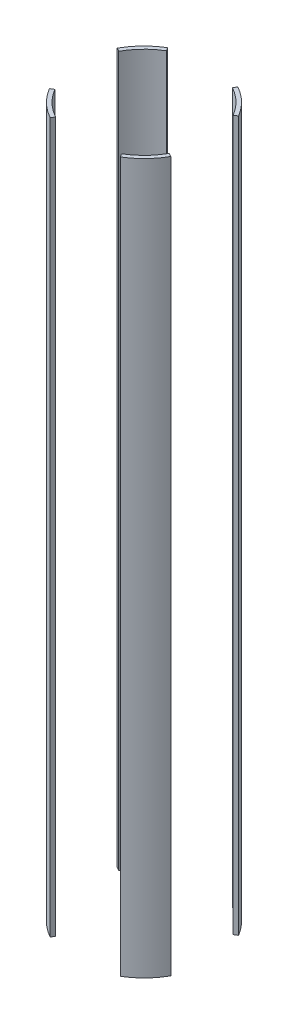
ISO-10303-21;
HEADER;
FILE_DESCRIPTION(('STEP AP214'),'2;1');
FILE_NAME('part.step','',(''),(''),'','','');
FILE_SCHEMA(('AUTOMOTIVE_DESIGN { 1 0 10303 214 1 1 1 1 }'));
ENDSEC;
DATA;
#1=APPLICATION_CONTEXT('core data for automotive mechanical design processes');
#2=APPLICATION_PROTOCOL_DEFINITION('international standard','automotive_design',2000,#1);
#3=PRODUCT_CONTEXT('',#1,'mechanical');
#4=PRODUCT('Part','Part','',(#3));
#5=PRODUCT_RELATED_PRODUCT_CATEGORY('part','',(#4));
#6=PRODUCT_DEFINITION_FORMATION('','',#4);
#7=PRODUCT_DEFINITION_CONTEXT('part definition',#1,'design');
#8=PRODUCT_DEFINITION('design','',#6,#7);
#9=PRODUCT_DEFINITION_SHAPE('','',#8);
#10=(LENGTH_UNIT() NAMED_UNIT(*) SI_UNIT(.MILLI.,.METRE.));
#11=(NAMED_UNIT(*) PLANE_ANGLE_UNIT() SI_UNIT($,.RADIAN.));
#12=(NAMED_UNIT(*) SI_UNIT($,.STERADIAN.) SOLID_ANGLE_UNIT());
#13=UNCERTAINTY_MEASURE_WITH_UNIT(LENGTH_MEASURE(1.E-05),#10,'distance_accuracy_value','');
#14=(GEOMETRIC_REPRESENTATION_CONTEXT(3) GLOBAL_UNCERTAINTY_ASSIGNED_CONTEXT((#13)) GLOBAL_UNIT_ASSIGNED_CONTEXT((#10,
#11,#12)) REPRESENTATION_CONTEXT('',''));
#15=CARTESIAN_POINT('',(0.,0.,0.));
#16=DIRECTION('',(0.,0.,1.));
#17=DIRECTION('',(1.,0.,0.));
#18=AXIS2_PLACEMENT_3D('',#15,#16,#17);
#19=CARTESIAN_POINT('',(0.,-457.2,0.));
#20=DIRECTION('',(0.,1.,0.));
#21=DIRECTION('',(0.,0.,1.));
#22=AXIS2_PLACEMENT_3D('',#19,#20,#21);
#23=PLANE('',#22);
#24=DIRECTION('',(0.48581550952375,0.,-0.874061376967418));
#25=VECTOR('',#24,1.);
#26=CARTESIAN_POINT('',(0.,-457.2,0.));
#27=LINE('',#26,#25);
#28=CARTESIAN_POINT('',(-43.1889987966614,-457.2,77.7040564124034));
#29=VERTEX_POINT('',#28);
#30=CARTESIAN_POINT('',(-40.7210560082808,-457.2,73.263824617409));
#31=VERTEX_POINT('',#30);
#32=EDGE_CURVE('E13',#29,#31,#27,.T.);
#33=ORIENTED_EDGE('',*,*,#32,.F.);
#34=CARTESIAN_POINT('',(0.,-457.2,0.));
#35=DIRECTION('',(0.,1.,0.));
#36=DIRECTION('',(0.,0.,1.));
#37=AXIS2_PLACEMENT_3D('',#34,#35,#36);
#38=CIRCLE('',#37,88.9);
#39=CARTESIAN_POINT('',(-76.2547983281261,-457.2,45.6991874319097));
#40=VERTEX_POINT('',#39);
#41=EDGE_CURVE('E279',#40,#29,#38,.T.);
#42=ORIENTED_EDGE('',*,*,#41,.F.);
#43=DIRECTION('',(0.857759261283758,0.,-0.514051602158714));
#44=VECTOR('',#43,1.);
#45=CARTESIAN_POINT('',(0.,-457.2,0.));
#46=LINE('',#45,#44);
#47=CARTESIAN_POINT('',(-71.8973812808046,-457.2,43.0878052929434));
#48=VERTEX_POINT('',#47);
#49=EDGE_CURVE('E274',#40,#48,#46,.T.);
#50=ORIENTED_EDGE('',*,*,#49,.T.);
#51=CARTESIAN_POINT('',(0.,-457.2,0.));
#52=DIRECTION('',(0.,1.,0.));
#53=DIRECTION('',(0.,0.,1.));
#54=AXIS2_PLACEMENT_3D('',#51,#52,#53);
#55=CIRCLE('',#54,83.82);
#56=EDGE_CURVE('E233',#48,#31,#55,.T.);
#57=ORIENTED_EDGE('',*,*,#56,.T.);
#58=EDGE_LOOP('',(#33,#42,#50,#57));
#59=FACE_BOUND('',#58,.T.);
#60=ADVANCED_FACE('F230',(#59),#23,.F.);
#61=CARTESIAN_POINT('',(0.,457.2,0.));
#62=DIRECTION('',(0.,1.,0.));
#63=DIRECTION('',(0.,0.,1.));
#64=AXIS2_PLACEMENT_3D('',#61,#62,#63);
#65=PLANE('',#64);
#66=CARTESIAN_POINT('',(0.,457.2,0.));
#67=DIRECTION('',(0.,1.,0.));
#68=DIRECTION('',(0.,0.,1.));
#69=AXIS2_PLACEMENT_3D('',#66,#67,#68);
#70=CIRCLE('',#69,88.9);
#71=CARTESIAN_POINT('',(-76.2547983281261,457.2,45.6991874319097));
#72=VERTEX_POINT('',#71);
#73=CARTESIAN_POINT('',(-43.1889987966614,457.2,77.7040564124034));
#74=VERTEX_POINT('',#73);
#75=EDGE_CURVE('E285',#72,#74,#70,.T.);
#76=ORIENTED_EDGE('',*,*,#75,.T.);
#77=DIRECTION('',(0.48581550952375,0.,-0.874061376967418));
#78=VECTOR('',#77,1.);
#79=CARTESIAN_POINT('',(0.,457.2,0.));
#80=LINE('',#79,#78);
#81=CARTESIAN_POINT('',(-40.7210560082808,457.2,73.263824617409));
#82=VERTEX_POINT('',#81);
#83=EDGE_CURVE('E246',#74,#82,#80,.T.);
#84=ORIENTED_EDGE('',*,*,#83,.T.);
#85=CARTESIAN_POINT('',(0.,457.2,0.));
#86=DIRECTION('',(0.,1.,0.));
#87=DIRECTION('',(0.,0.,1.));
#88=AXIS2_PLACEMENT_3D('',#85,#86,#87);
#89=CIRCLE('',#88,83.82);
#90=CARTESIAN_POINT('',(-71.8973812808046,457.2,43.0878052929434));
#91=VERTEX_POINT('',#90);
#92=EDGE_CURVE('E287',#91,#82,#89,.T.);
#93=ORIENTED_EDGE('',*,*,#92,.F.);
#94=DIRECTION('',(0.857759261283758,0.,-0.514051602158714));
#95=VECTOR('',#94,1.);
#96=CARTESIAN_POINT('',(0.,457.2,0.));
#97=LINE('',#96,#95);
#98=EDGE_CURVE('E271',#72,#91,#97,.T.);
#99=ORIENTED_EDGE('',*,*,#98,.F.);
#100=EDGE_LOOP('',(#76,#84,#93,#99));
#101=FACE_BOUND('',#100,.T.);
#102=ADVANCED_FACE('F284',(#101),#65,.T.);
#103=CARTESIAN_POINT('',(0.,457.2,0.));
#104=DIRECTION('',(0.,-1.,0.));
#105=DIRECTION('',(0.,0.,-1.));
#106=AXIS2_PLACEMENT_3D('',#103,#104,#105);
#107=CYLINDRICAL_SURFACE('',#106,88.9);
#108=DIRECTION('',(0.,-1.,0.));
#109=VECTOR('',#108,1.);
#110=CARTESIAN_POINT('',(-43.1889987966614,457.2,77.7040564124034));
#111=LINE('',#110,#109);
#112=EDGE_CURVE('E238',#74,#29,#111,.T.);
#113=ORIENTED_EDGE('',*,*,#112,.F.);
#114=ORIENTED_EDGE('',*,*,#75,.F.);
#115=DIRECTION('',(0.,-1.,0.));
#116=VECTOR('',#115,1.);
#117=CARTESIAN_POINT('',(-76.2547983281261,457.2,45.6991874319097));
#118=LINE('',#117,#116);
#119=EDGE_CURVE('E268',#72,#40,#118,.T.);
#120=ORIENTED_EDGE('',*,*,#119,.T.);
#121=ORIENTED_EDGE('',*,*,#41,.T.);
#122=EDGE_LOOP('',(#113,#114,#120,#121));
#123=FACE_BOUND('',#122,.T.);
#124=ADVANCED_FACE('F290',(#123),#107,.T.);
#125=CARTESIAN_POINT('',(0.,457.2,0.));
#126=DIRECTION('',(0.,-1.,0.));
#127=DIRECTION('',(0.,0.,-1.));
#128=AXIS2_PLACEMENT_3D('',#125,#126,#127);
#129=CYLINDRICAL_SURFACE('',#128,83.82);
#130=ORIENTED_EDGE('',*,*,#92,.T.);
#131=DIRECTION('',(0.,-1.,0.));
#132=VECTOR('',#131,1.);
#133=CARTESIAN_POINT('',(-40.7210560082807,457.2,73.263824617409));
#134=LINE('',#133,#132);
#135=EDGE_CURVE('E250',#82,#31,#134,.T.);
#136=ORIENTED_EDGE('',*,*,#135,.T.);
#137=ORIENTED_EDGE('',*,*,#56,.F.);
#138=DIRECTION('',(0.,-1.,0.));
#139=VECTOR('',#138,1.);
#140=CARTESIAN_POINT('',(-71.8973812808046,457.2,43.0878052929434));
#141=LINE('',#140,#139);
#142=EDGE_CURVE('E288',#91,#48,#141,.T.);
#143=ORIENTED_EDGE('',*,*,#142,.F.);
#144=EDGE_LOOP('',(#130,#136,#137,#143));
#145=FACE_BOUND('',#144,.T.);
#146=ADVANCED_FACE('F304',(#145),#129,.F.);
#147=CARTESIAN_POINT('',(0.,-457.2,0.));
#148=DIRECTION('',(0.514051602158714,0.,0.857759261283758));
#149=DIRECTION('',(0.857759261283758,0.,-0.514051602158714));
#150=AXIS2_PLACEMENT_3D('',#147,#148,#149);
#151=PLANE('',#150);
#152=ORIENTED_EDGE('',*,*,#142,.T.);
#153=ORIENTED_EDGE('',*,*,#49,.F.);
#154=ORIENTED_EDGE('',*,*,#119,.F.);
#155=ORIENTED_EDGE('',*,*,#98,.T.);
#156=EDGE_LOOP('',(#152,#153,#154,#155));
#157=FACE_BOUND('',#156,.T.);
#158=ADVANCED_FACE('F270',(#157),#151,.F.);
#159=CARTESIAN_POINT('',(0.,-457.2,0.));
#160=DIRECTION('',(0.874061376967418,0.,0.48581550952375));
#161=DIRECTION('',(0.48581550952375,0.,-0.874061376967418));
#162=AXIS2_PLACEMENT_3D('',#159,#160,#161);
#163=PLANE('',#162);
#164=ORIENTED_EDGE('',*,*,#112,.T.);
#165=ORIENTED_EDGE('',*,*,#32,.T.);
#166=ORIENTED_EDGE('',*,*,#135,.F.);
#167=ORIENTED_EDGE('',*,*,#83,.F.);
#168=EDGE_LOOP('',(#164,#165,#166,#167));
#169=FACE_BOUND('',#168,.T.);
#170=ADVANCED_FACE('F302',(#169),#163,.T.);
#171=CLOSED_SHELL('',(#60,#102,#124,#146,#158,#170));
#172=MANIFOLD_SOLID_BREP('B2',#171);
#173=CARTESIAN_POINT('',(0.,457.2,0.));
#174=DIRECTION('',(0.,-1.,0.));
#175=DIRECTION('',(0.,0.,-1.));
#176=AXIS2_PLACEMENT_3D('',#173,#174,#175);
#177=CYLINDRICAL_SURFACE('',#176,83.82);
#178=DIRECTION('',(0.,-1.,0.));
#179=VECTOR('',#178,1.);
#180=CARTESIAN_POINT('',(-73.2638246174091,457.2,-40.7210560082805));
#181=LINE('',#180,#179);
#182=CARTESIAN_POINT('',(-73.2638246174091,-457.2,-40.7210560082805));
#183=VERTEX_POINT('',#182);
#184=CARTESIAN_POINT('',(-73.2638246174091,457.2,-40.7210560082805));
#185=VERTEX_POINT('',#184);
#186=EDGE_CURVE('E374',#183,#185,#181,.F.);
#187=ORIENTED_EDGE('',*,*,#186,.F.);
#188=CARTESIAN_POINT('',(0.,-457.2,0.));
#189=DIRECTION('',(0.,1.,0.));
#190=DIRECTION('',(0.,0.,1.));
#191=AXIS2_PLACEMENT_3D('',#188,#189,#190);
#192=CIRCLE('',#191,83.82);
#193=CARTESIAN_POINT('',(-43.0878052929431,-457.2,-71.8973812808048));
#194=VERTEX_POINT('',#193);
#195=EDGE_CURVE('E367',#194,#183,#192,.T.);
#196=ORIENTED_EDGE('',*,*,#195,.F.);
#197=DIRECTION('',(0.,-1.,0.));
#198=VECTOR('',#197,1.);
#199=CARTESIAN_POINT('',(-43.0878052929431,457.2,-71.8973812808048));
#200=LINE('',#199,#198);
#201=CARTESIAN_POINT('',(-43.0878052929431,457.2,-71.8973812808048));
#202=VERTEX_POINT('',#201);
#203=EDGE_CURVE('E426',#202,#194,#200,.T.);
#204=ORIENTED_EDGE('',*,*,#203,.F.);
#205=CARTESIAN_POINT('',(0.,457.2,0.));
#206=DIRECTION('',(0.,1.,0.));
#207=DIRECTION('',(0.,0.,1.));
#208=AXIS2_PLACEMENT_3D('',#205,#206,#207);
#209=CIRCLE('',#208,83.82);
#210=EDGE_CURVE('E433',#202,#185,#209,.T.);
#211=ORIENTED_EDGE('',*,*,#210,.T.);
#212=EDGE_LOOP('',(#187,#196,#204,#211));
#213=FACE_BOUND('',#212,.T.);
#214=ADVANCED_FACE('F364',(#213),#177,.F.);
#215=CARTESIAN_POINT('',(0.,457.2,0.));
#216=DIRECTION('',(0.,-1.,0.));
#217=DIRECTION('',(0.,0.,-1.));
#218=AXIS2_PLACEMENT_3D('',#215,#216,#217);
#219=CYLINDRICAL_SURFACE('',#218,88.9);
#220=CARTESIAN_POINT('',(0.,-457.2,0.));
#221=DIRECTION('',(0.,1.,0.));
#222=DIRECTION('',(0.,0.,1.));
#223=AXIS2_PLACEMENT_3D('',#220,#221,#222);
#224=CIRCLE('',#223,88.9);
#225=CARTESIAN_POINT('',(-45.6991874319094,-457.2,-76.2547983281263));
#226=VERTEX_POINT('',#225);
#227=CARTESIAN_POINT('',(-77.7040564124036,-457.2,-43.1889987966612));
#228=VERTEX_POINT('',#227);
#229=EDGE_CURVE('E414',#226,#228,#224,.T.);
#230=ORIENTED_EDGE('',*,*,#229,.T.);
#231=DIRECTION('',(0.,-1.,0.));
#232=VECTOR('',#231,1.);
#233=CARTESIAN_POINT('',(-77.7040564124036,457.2,-43.1889987966612));
#234=LINE('',#233,#232);
#235=CARTESIAN_POINT('',(-77.7040564124036,457.2,-43.1889987966612));
#236=VERTEX_POINT('',#235);
#237=EDGE_CURVE('E402',#228,#236,#234,.F.);
#238=ORIENTED_EDGE('',*,*,#237,.T.);
#239=CARTESIAN_POINT('',(0.,457.2,0.));
#240=DIRECTION('',(0.,1.,0.));
#241=DIRECTION('',(0.,0.,1.));
#242=AXIS2_PLACEMENT_3D('',#239,#240,#241);
#243=CIRCLE('',#242,88.9);
#244=CARTESIAN_POINT('',(-45.6991874319094,457.2,-76.2547983281263));
#245=VERTEX_POINT('',#244);
#246=EDGE_CURVE('E412',#245,#236,#243,.T.);
#247=ORIENTED_EDGE('',*,*,#246,.F.);
#248=DIRECTION('',(0.,-1.,0.));
#249=VECTOR('',#248,1.);
#250=CARTESIAN_POINT('',(-45.6991874319094,457.2,-76.2547983281263));
#251=LINE('',#250,#249);
#252=EDGE_CURVE('E416',#245,#226,#251,.T.);
#253=ORIENTED_EDGE('',*,*,#252,.T.);
#254=EDGE_LOOP('',(#230,#238,#247,#253));
#255=FACE_BOUND('',#254,.T.);
#256=ADVANCED_FACE('F410',(#255),#219,.T.);
#257=CARTESIAN_POINT('',(0.,-457.2,0.));
#258=DIRECTION('',(0.,1.,0.));
#259=DIRECTION('',(0.,0.,1.));
#260=AXIS2_PLACEMENT_3D('',#257,#258,#259);
#261=PLANE('',#260);
#262=ORIENTED_EDGE('',*,*,#195,.T.);
#263=DIRECTION('',(-0.87406137696742,0.,-0.485815509523748));
#264=VECTOR('',#263,1.);
#265=CARTESIAN_POINT('',(0.,-457.2,0.));
#266=LINE('',#265,#264);
#267=EDGE_CURVE('E382',#183,#228,#266,.T.);
#268=ORIENTED_EDGE('',*,*,#267,.T.);
#269=ORIENTED_EDGE('',*,*,#229,.F.);
#270=DIRECTION('',(0.514051602158711,0.,0.85775926128376));
#271=VECTOR('',#270,1.);
#272=CARTESIAN_POINT('',(0.,-457.2,0.));
#273=LINE('',#272,#271);
#274=EDGE_CURVE('E422',#226,#194,#273,.T.);
#275=ORIENTED_EDGE('',*,*,#274,.T.);
#276=EDGE_LOOP('',(#262,#268,#269,#275));
#277=FACE_BOUND('',#276,.T.);
#278=ADVANCED_FACE('F449',(#277),#261,.F.);
#279=CARTESIAN_POINT('',(0.,457.2,0.));
#280=DIRECTION('',(0.,1.,0.));
#281=DIRECTION('',(0.,0.,1.));
#282=AXIS2_PLACEMENT_3D('',#279,#280,#281);
#283=PLANE('',#282);
#284=DIRECTION('',(-0.87406137696742,0.,-0.485815509523748));
#285=VECTOR('',#284,1.);
#286=CARTESIAN_POINT('',(0.,457.2,0.));
#287=LINE('',#286,#285);
#288=EDGE_CURVE('E228',#185,#236,#287,.T.);
#289=ORIENTED_EDGE('',*,*,#288,.F.);
#290=ORIENTED_EDGE('',*,*,#210,.F.);
#291=DIRECTION('',(0.514051602158711,0.,0.85775926128376));
#292=VECTOR('',#291,1.);
#293=CARTESIAN_POINT('',(0.,457.2,0.));
#294=LINE('',#293,#292);
#295=EDGE_CURVE('E420',#245,#202,#294,.T.);
#296=ORIENTED_EDGE('',*,*,#295,.F.);
#297=ORIENTED_EDGE('',*,*,#246,.T.);
#298=EDGE_LOOP('',(#289,#290,#296,#297));
#299=FACE_BOUND('',#298,.T.);
#300=ADVANCED_FACE('F419',(#299),#283,.T.);
#301=CARTESIAN_POINT('',(0.,-457.2,0.));
#302=DIRECTION('',(-0.85775926128376,0.,0.514051602158711));
#303=DIRECTION('',(0.514051602158711,0.,0.857759261283761));
#304=AXIS2_PLACEMENT_3D('',#301,#302,#303);
#305=PLANE('',#304);
#306=ORIENTED_EDGE('',*,*,#295,.T.);
#307=ORIENTED_EDGE('',*,*,#203,.T.);
#308=ORIENTED_EDGE('',*,*,#274,.F.);
#309=ORIENTED_EDGE('',*,*,#252,.F.);
#310=EDGE_LOOP('',(#306,#307,#308,#309));
#311=FACE_BOUND('',#310,.T.);
#312=ADVANCED_FACE('F450',(#311),#305,.F.);
#313=CARTESIAN_POINT('',(0.,-457.2,0.));
#314=DIRECTION('',(0.485815509523748,0.,-0.87406137696742));
#315=DIRECTION('',(-0.87406137696742,0.,-0.485815509523748));
#316=AXIS2_PLACEMENT_3D('',#313,#314,#315);
#317=PLANE('',#316);
#318=ORIENTED_EDGE('',*,*,#186,.T.);
#319=ORIENTED_EDGE('',*,*,#288,.T.);
#320=ORIENTED_EDGE('',*,*,#237,.F.);
#321=ORIENTED_EDGE('',*,*,#267,.F.);
#322=EDGE_LOOP('',(#318,#319,#320,#321));
#323=FACE_BOUND('',#322,.T.);
#324=ADVANCED_FACE('F401',(#323),#317,.F.);
#325=CLOSED_SHELL('',(#214,#256,#278,#300,#312,#324));
#326=MANIFOLD_SOLID_BREP('B7',#325);
#327=CARTESIAN_POINT('',(0.,457.2,0.));
#328=DIRECTION('',(0.,1.,0.));
#329=DIRECTION('',(0.,0.,1.));
#330=AXIS2_PLACEMENT_3D('',#327,#328,#329);
#331=PLANE('',#330);
#332=DIRECTION('',(0.485815509523751,0.,-0.874061376967418));
#333=VECTOR('',#332,1.);
#334=CARTESIAN_POINT('',(0.,457.2,0.));
#335=LINE('',#334,#333);
#336=CARTESIAN_POINT('',(40.7210560082808,457.2,-73.2638246174089));
#337=VERTEX_POINT('',#336);
#338=CARTESIAN_POINT('',(43.1889987966614,457.2,-77.7040564124034));
#339=VERTEX_POINT('',#338);
#340=EDGE_CURVE('E362',#337,#339,#335,.T.);
#341=ORIENTED_EDGE('',*,*,#340,.F.);
#342=CARTESIAN_POINT('',(0.,457.2,0.));
#343=DIRECTION('',(0.,1.,0.));
#344=DIRECTION('',(0.,0.,1.));
#345=AXIS2_PLACEMENT_3D('',#342,#343,#344);
#346=CIRCLE('',#345,83.82);
#347=CARTESIAN_POINT('',(71.8973812808046,457.2,-43.0878052929434));
#348=VERTEX_POINT('',#347);
#349=EDGE_CURVE('E557',#348,#337,#346,.T.);
#350=ORIENTED_EDGE('',*,*,#349,.F.);
#351=DIRECTION('',(0.857759261283759,0.,-0.514051602158714));
#352=VECTOR('',#351,1.);
#353=CARTESIAN_POINT('',(0.,457.2,0.));
#354=LINE('',#353,#352);
#355=CARTESIAN_POINT('',(76.2547983281261,457.2,-45.6991874319097));
#356=VERTEX_POINT('',#355);
#357=EDGE_CURVE('E570',#348,#356,#354,.T.);
#358=ORIENTED_EDGE('',*,*,#357,.T.);
#359=CARTESIAN_POINT('',(0.,457.2,0.));
#360=DIRECTION('',(0.,1.,0.));
#361=DIRECTION('',(0.,0.,1.));
#362=AXIS2_PLACEMENT_3D('',#359,#360,#361);
#363=CIRCLE('',#362,88.9);
#364=EDGE_CURVE('E559',#356,#339,#363,.T.);
#365=ORIENTED_EDGE('',*,*,#364,.T.);
#366=EDGE_LOOP('',(#341,#350,#358,#365));
#367=FACE_BOUND('',#366,.T.);
#368=ADVANCED_FACE('F509',(#367),#331,.T.);
#369=CARTESIAN_POINT('',(0.,-457.2,0.));
#370=DIRECTION('',(0.,1.,0.));
#371=DIRECTION('',(0.,0.,1.));
#372=AXIS2_PLACEMENT_3D('',#369,#370,#371);
#373=PLANE('',#372);
#374=CARTESIAN_POINT('',(0.,-457.2,0.));
#375=DIRECTION('',(0.,1.,0.));
#376=DIRECTION('',(0.,0.,1.));
#377=AXIS2_PLACEMENT_3D('',#374,#375,#376);
#378=CIRCLE('',#377,83.82);
#379=CARTESIAN_POINT('',(71.8973812808046,-457.2,-43.0878052929434));
#380=VERTEX_POINT('',#379);
#381=CARTESIAN_POINT('',(40.7210560082808,-457.2,-73.2638246174089));
#382=VERTEX_POINT('',#381);
#383=EDGE_CURVE('E512',#380,#382,#378,.T.);
#384=ORIENTED_EDGE('',*,*,#383,.T.);
#385=DIRECTION('',(0.485815509523751,0.,-0.874061376967418));
#386=VECTOR('',#385,1.);
#387=CARTESIAN_POINT('',(0.,-457.2,0.));
#388=LINE('',#387,#386);
#389=CARTESIAN_POINT('',(43.1889987966614,-457.2,-77.7040564124034));
#390=VERTEX_POINT('',#389);
#391=EDGE_CURVE('E543',#382,#390,#388,.T.);
#392=ORIENTED_EDGE('',*,*,#391,.T.);
#393=CARTESIAN_POINT('',(0.,-457.2,0.));
#394=DIRECTION('',(0.,1.,0.));
#395=DIRECTION('',(0.,0.,1.));
#396=AXIS2_PLACEMENT_3D('',#393,#394,#395);
#397=CIRCLE('',#396,88.9);
#398=CARTESIAN_POINT('',(76.2547983281261,-457.2,-45.6991874319097));
#399=VERTEX_POINT('',#398);
#400=EDGE_CURVE('E567',#399,#390,#397,.T.);
#401=ORIENTED_EDGE('',*,*,#400,.F.);
#402=DIRECTION('',(0.857759261283759,0.,-0.514051602158714));
#403=VECTOR('',#402,1.);
#404=CARTESIAN_POINT('',(0.,-457.2,0.));
#405=LINE('',#404,#403);
#406=EDGE_CURVE('E551',#380,#399,#405,.T.);
#407=ORIENTED_EDGE('',*,*,#406,.F.);
#408=EDGE_LOOP('',(#384,#392,#401,#407));
#409=FACE_BOUND('',#408,.T.);
#410=ADVANCED_FACE('F583',(#409),#373,.F.);
#411=CARTESIAN_POINT('',(0.,457.2,0.));
#412=DIRECTION('',(0.,-1.,0.));
#413=DIRECTION('',(0.,0.,-1.));
#414=AXIS2_PLACEMENT_3D('',#411,#412,#413);
#415=CYLINDRICAL_SURFACE('',#414,88.9);
#416=ORIENTED_EDGE('',*,*,#400,.T.);
#417=DIRECTION('',(0.,-1.,0.));
#418=VECTOR('',#417,1.);
#419=CARTESIAN_POINT('',(43.1889987966614,457.2,-77.7040564124034));
#420=LINE('',#419,#418);
#421=EDGE_CURVE('E526',#390,#339,#420,.F.);
#422=ORIENTED_EDGE('',*,*,#421,.T.);
#423=ORIENTED_EDGE('',*,*,#364,.F.);
#424=DIRECTION('',(0.,-1.,0.));
#425=VECTOR('',#424,1.);
#426=CARTESIAN_POINT('',(76.2547983281261,457.2,-45.6991874319097));
#427=LINE('',#426,#425);
#428=EDGE_CURVE('E563',#399,#356,#427,.F.);
#429=ORIENTED_EDGE('',*,*,#428,.F.);
#430=EDGE_LOOP('',(#416,#422,#423,#429));
#431=FACE_BOUND('',#430,.T.);
#432=ADVANCED_FACE('F582',(#431),#415,.T.);
#433=CARTESIAN_POINT('',(0.,457.2,0.));
#434=DIRECTION('',(0.,-1.,0.));
#435=DIRECTION('',(0.,0.,-1.));
#436=AXIS2_PLACEMENT_3D('',#433,#434,#435);
#437=CYLINDRICAL_SURFACE('',#436,83.82);
#438=DIRECTION('',(0.,-1.,0.));
#439=VECTOR('',#438,1.);
#440=CARTESIAN_POINT('',(40.7210560082808,457.2,-73.2638246174089));
#441=LINE('',#440,#439);
#442=EDGE_CURVE('E518',#382,#337,#441,.F.);
#443=ORIENTED_EDGE('',*,*,#442,.F.);
#444=ORIENTED_EDGE('',*,*,#383,.F.);
#445=DIRECTION('',(0.,-1.,0.));
#446=VECTOR('',#445,1.);
#447=CARTESIAN_POINT('',(71.8973812808046,457.2,-43.0878052929434));
#448=LINE('',#447,#446);
#449=EDGE_CURVE('E562',#380,#348,#448,.F.);
#450=ORIENTED_EDGE('',*,*,#449,.T.);
#451=ORIENTED_EDGE('',*,*,#349,.T.);
#452=EDGE_LOOP('',(#443,#444,#450,#451));
#453=FACE_BOUND('',#452,.T.);
#454=ADVANCED_FACE('F561',(#453),#437,.F.);
#455=CARTESIAN_POINT('',(0.,-457.2,0.));
#456=DIRECTION('',(0.514051602158714,0.,0.857759261283758));
#457=DIRECTION('',(0.857759261283759,0.,-0.514051602158714));
#458=AXIS2_PLACEMENT_3D('',#455,#456,#457);
#459=PLANE('',#458);
#460=ORIENTED_EDGE('',*,*,#428,.T.);
#461=ORIENTED_EDGE('',*,*,#357,.F.);
#462=ORIENTED_EDGE('',*,*,#449,.F.);
#463=ORIENTED_EDGE('',*,*,#406,.T.);
#464=EDGE_LOOP('',(#460,#461,#462,#463));
#465=FACE_BOUND('',#464,.T.);
#466=ADVANCED_FACE('F578',(#465),#459,.T.);
#467=CARTESIAN_POINT('',(0.,-457.2,0.));
#468=DIRECTION('',(0.874061376967418,0.,0.485815509523751));
#469=DIRECTION('',(0.485815509523751,0.,-0.874061376967418));
#470=AXIS2_PLACEMENT_3D('',#467,#468,#469);
#471=PLANE('',#470);
#472=ORIENTED_EDGE('',*,*,#391,.F.);
#473=ORIENTED_EDGE('',*,*,#442,.T.);
#474=ORIENTED_EDGE('',*,*,#340,.T.);
#475=ORIENTED_EDGE('',*,*,#421,.F.);
#476=EDGE_LOOP('',(#472,#473,#474,#475));
#477=FACE_BOUND('',#476,.T.);
#478=ADVANCED_FACE('F546',(#477),#471,.F.);
#479=CLOSED_SHELL('',(#368,#410,#432,#454,#466,#478));
#480=MANIFOLD_SOLID_BREP('B222',#479);
#481=CARTESIAN_POINT('',(0.,-457.2,0.));
#482=DIRECTION('',(0.485815509523748,0.,-0.874061376967419));
#483=DIRECTION('',(-0.87406137696742,0.,-0.485815509523748));
#484=AXIS2_PLACEMENT_3D('',#481,#482,#483);
#485=PLANE('',#484);
#486=DIRECTION('',(0.,-1.,0.));
#487=VECTOR('',#486,1.);
#488=CARTESIAN_POINT('',(77.7040564124036,457.2,43.1889987966612));
#489=LINE('',#488,#487);
#490=CARTESIAN_POINT('',(77.7040564124036,457.2,43.1889987966612));
#491=VERTEX_POINT('',#490);
#492=CARTESIAN_POINT('',(77.7040564124036,-457.2,43.1889987966612));
#493=VERTEX_POINT('',#492);
#494=EDGE_CURVE('E691',#491,#493,#489,.T.);
#495=ORIENTED_EDGE('',*,*,#494,.T.);
#496=DIRECTION('',(-0.87406137696742,0.,-0.485815509523748));
#497=VECTOR('',#496,1.);
#498=CARTESIAN_POINT('',(0.,-457.2,0.));
#499=LINE('',#498,#497);
#500=CARTESIAN_POINT('',(73.2638246174091,-457.2,40.7210560082805));
#501=VERTEX_POINT('',#500);
#502=EDGE_CURVE('E700',#493,#501,#499,.T.);
#503=ORIENTED_EDGE('',*,*,#502,.T.);
#504=DIRECTION('',(0.,-1.,0.));
#505=VECTOR('',#504,1.);
#506=CARTESIAN_POINT('',(73.2638246174091,457.2,40.7210560082805));
#507=LINE('',#506,#505);
#508=CARTESIAN_POINT('',(73.2638246174091,457.2,40.7210560082805));
#509=VERTEX_POINT('',#508);
#510=EDGE_CURVE('E641',#509,#501,#507,.T.);
#511=ORIENTED_EDGE('',*,*,#510,.F.);
#512=DIRECTION('',(-0.87406137696742,0.,-0.485815509523748));
#513=VECTOR('',#512,1.);
#514=CARTESIAN_POINT('',(0.,457.2,0.));
#515=LINE('',#514,#513);
#516=EDGE_CURVE('E679',#491,#509,#515,.T.);
#517=ORIENTED_EDGE('',*,*,#516,.F.);
#518=EDGE_LOOP('',(#495,#503,#511,#517));
#519=FACE_BOUND('',#518,.T.);
#520=ADVANCED_FACE('F633',(#519),#485,.T.);
#521=CARTESIAN_POINT('',(0.,457.2,0.));
#522=DIRECTION('',(0.,-1.,0.));
#523=DIRECTION('',(0.,0.,-1.));
#524=AXIS2_PLACEMENT_3D('',#521,#522,#523);
#525=CYLINDRICAL_SURFACE('',#524,88.9);
#526=DIRECTION('',(0.,-1.,0.));
#527=VECTOR('',#526,1.);
#528=CARTESIAN_POINT('',(45.6991874319094,457.2,76.2547983281263));
#529=LINE('',#528,#527);
#530=CARTESIAN_POINT('',(45.6991874319095,-457.2,76.2547983281263));
#531=VERTEX_POINT('',#530);
#532=CARTESIAN_POINT('',(45.6991874319095,457.2,76.2547983281263));
#533=VERTEX_POINT('',#532);
#534=EDGE_CURVE('E673',#531,#533,#529,.F.);
#535=ORIENTED_EDGE('',*,*,#534,.F.);
#536=CARTESIAN_POINT('',(0.,-457.2,0.));
#537=DIRECTION('',(0.,1.,0.));
#538=DIRECTION('',(0.,0.,1.));
#539=AXIS2_PLACEMENT_3D('',#536,#537,#538);
#540=CIRCLE('',#539,88.9);
#541=EDGE_CURVE('E692',#531,#493,#540,.T.);
#542=ORIENTED_EDGE('',*,*,#541,.T.);
#543=ORIENTED_EDGE('',*,*,#494,.F.);
#544=CARTESIAN_POINT('',(0.,457.2,0.));
#545=DIRECTION('',(0.,1.,0.));
#546=DIRECTION('',(0.,0.,1.));
#547=AXIS2_PLACEMENT_3D('',#544,#545,#546);
#548=CIRCLE('',#547,88.9);
#549=EDGE_CURVE('E685',#533,#491,#548,.T.);
#550=ORIENTED_EDGE('',*,*,#549,.F.);
#551=EDGE_LOOP('',(#535,#542,#543,#550));
#552=FACE_BOUND('',#551,.T.);
#553=ADVANCED_FACE('F635',(#552),#525,.T.);
#554=CARTESIAN_POINT('',(0.,457.2,0.));
#555=DIRECTION('',(0.,-1.,0.));
#556=DIRECTION('',(0.,0.,-1.));
#557=AXIS2_PLACEMENT_3D('',#554,#555,#556);
#558=CYLINDRICAL_SURFACE('',#557,83.82);
#559=CARTESIAN_POINT('',(0.,-457.2,0.));
#560=DIRECTION('',(0.,1.,0.));
#561=DIRECTION('',(0.,0.,1.));
#562=AXIS2_PLACEMENT_3D('',#559,#560,#561);
#563=CIRCLE('',#562,83.82);
#564=CARTESIAN_POINT('',(43.0878052929432,-457.2,71.8973812808048));
#565=VERTEX_POINT('',#564);
#566=EDGE_CURVE('E655',#565,#501,#563,.T.);
#567=ORIENTED_EDGE('',*,*,#566,.F.);
#568=DIRECTION('',(0.,-1.,0.));
#569=VECTOR('',#568,1.);
#570=CARTESIAN_POINT('',(43.0878052929432,457.2,71.8973812808048));
#571=LINE('',#570,#569);
#572=CARTESIAN_POINT('',(43.0878052929432,457.2,71.8973812808048));
#573=VERTEX_POINT('',#572);
#574=EDGE_CURVE('E507',#565,#573,#571,.F.);
#575=ORIENTED_EDGE('',*,*,#574,.T.);
#576=CARTESIAN_POINT('',(0.,457.2,0.));
#577=DIRECTION('',(0.,1.,0.));
#578=DIRECTION('',(0.,0.,1.));
#579=AXIS2_PLACEMENT_3D('',#576,#577,#578);
#580=CIRCLE('',#579,83.82);
#581=EDGE_CURVE('E687',#573,#509,#580,.T.);
#582=ORIENTED_EDGE('',*,*,#581,.T.);
#583=ORIENTED_EDGE('',*,*,#510,.T.);
#584=EDGE_LOOP('',(#567,#575,#582,#583));
#585=FACE_BOUND('',#584,.T.);
#586=ADVANCED_FACE('F706',(#585),#558,.F.);
#587=CARTESIAN_POINT('',(0.,457.2,0.));
#588=DIRECTION('',(0.,1.,0.));
#589=DIRECTION('',(0.,0.,1.));
#590=AXIS2_PLACEMENT_3D('',#587,#588,#589);
#591=PLANE('',#590);
#592=ORIENTED_EDGE('',*,*,#581,.F.);
#593=DIRECTION('',(0.514051602158711,0.,0.85775926128376));
#594=VECTOR('',#593,1.);
#595=CARTESIAN_POINT('',(0.,457.2,0.));
#596=LINE('',#595,#594);
#597=EDGE_CURVE('E648',#573,#533,#596,.T.);
#598=ORIENTED_EDGE('',*,*,#597,.T.);
#599=ORIENTED_EDGE('',*,*,#549,.T.);
#600=ORIENTED_EDGE('',*,*,#516,.T.);
#601=EDGE_LOOP('',(#592,#598,#599,#600));
#602=FACE_BOUND('',#601,.T.);
#603=ADVANCED_FACE('F683',(#602),#591,.T.);
#604=CARTESIAN_POINT('',(0.,-457.2,0.));
#605=DIRECTION('',(0.,1.,0.));
#606=DIRECTION('',(0.,0.,1.));
#607=AXIS2_PLACEMENT_3D('',#604,#605,#606);
#608=PLANE('',#607);
#609=DIRECTION('',(0.514051602158711,0.,0.85775926128376));
#610=VECTOR('',#609,1.);
#611=CARTESIAN_POINT('',(0.,-457.2,0.));
#612=LINE('',#611,#610);
#613=EDGE_CURVE('E675',#565,#531,#612,.T.);
#614=ORIENTED_EDGE('',*,*,#613,.F.);
#615=ORIENTED_EDGE('',*,*,#566,.T.);
#616=ORIENTED_EDGE('',*,*,#502,.F.);
#617=ORIENTED_EDGE('',*,*,#541,.F.);
#618=EDGE_LOOP('',(#614,#615,#616,#617));
#619=FACE_BOUND('',#618,.T.);
#620=ADVANCED_FACE('F707',(#619),#608,.F.);
#621=CARTESIAN_POINT('',(0.,-457.2,0.));
#622=DIRECTION('',(-0.85775926128376,0.,0.514051602158711));
#623=DIRECTION('',(0.514051602158711,0.,0.85775926128376));
#624=AXIS2_PLACEMENT_3D('',#621,#622,#623);
#625=PLANE('',#624);
#626=ORIENTED_EDGE('',*,*,#534,.T.);
#627=ORIENTED_EDGE('',*,*,#597,.F.);
#628=ORIENTED_EDGE('',*,*,#574,.F.);
#629=ORIENTED_EDGE('',*,*,#613,.T.);
#630=EDGE_LOOP('',(#626,#627,#628,#629));
#631=FACE_BOUND('',#630,.T.);
#632=ADVANCED_FACE('F674',(#631),#625,.T.);
#633=CLOSED_SHELL('',(#520,#553,#586,#603,#620,#632));
#634=MANIFOLD_SOLID_BREP('B356',#633);
#635=ADVANCED_BREP_SHAPE_REPRESENTATION('',(#18,#172,#326,#480,#634),#14);
#636=SHAPE_DEFINITION_REPRESENTATION(#9,#635);
ENDSEC;
END-ISO-10303-21;
